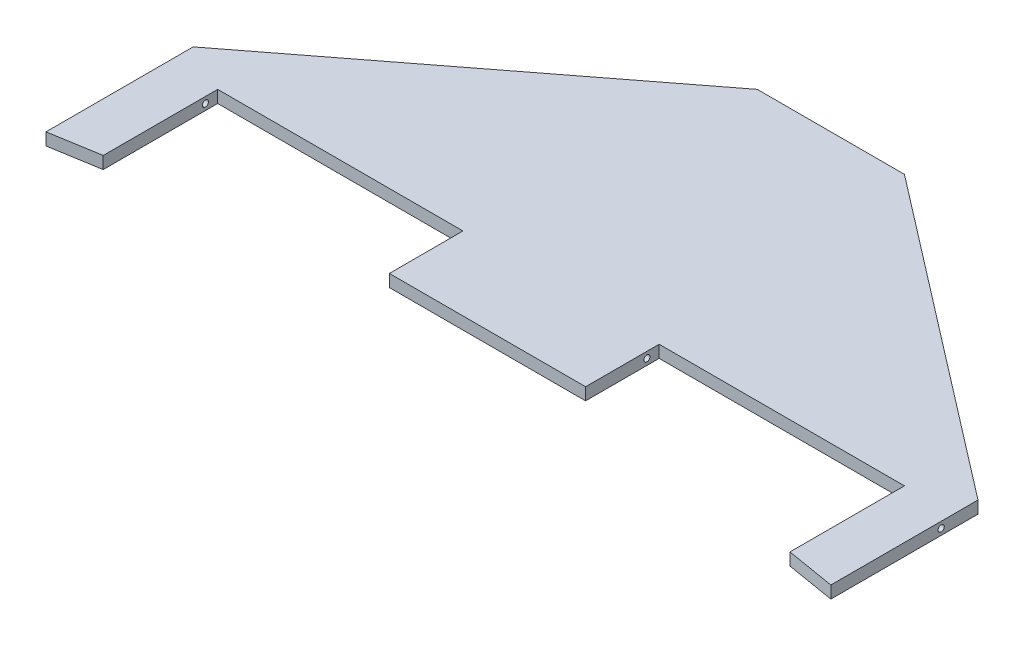
ISO-10303-21;
HEADER;
FILE_DESCRIPTION(('STEP AP214'),'2;1');
FILE_NAME('part.step','',(''),(''),'','','');
FILE_SCHEMA(('AUTOMOTIVE_DESIGN { 1 0 10303 214 1 1 1 1 }'));
ENDSEC;
DATA;
#1=APPLICATION_CONTEXT('core data for automotive mechanical design processes');
#2=APPLICATION_PROTOCOL_DEFINITION('international standard','automotive_design',2000,#1);
#3=PRODUCT_CONTEXT('',#1,'mechanical');
#4=PRODUCT('Part','Part','',(#3));
#5=PRODUCT_RELATED_PRODUCT_CATEGORY('part','',(#4));
#6=PRODUCT_DEFINITION_FORMATION('','',#4);
#7=PRODUCT_DEFINITION_CONTEXT('part definition',#1,'design');
#8=PRODUCT_DEFINITION('design','',#6,#7);
#9=PRODUCT_DEFINITION_SHAPE('','',#8);
#10=(LENGTH_UNIT() NAMED_UNIT(*) SI_UNIT(.MILLI.,.METRE.));
#11=(NAMED_UNIT(*) PLANE_ANGLE_UNIT() SI_UNIT($,.RADIAN.));
#12=(NAMED_UNIT(*) SI_UNIT($,.STERADIAN.) SOLID_ANGLE_UNIT());
#13=UNCERTAINTY_MEASURE_WITH_UNIT(LENGTH_MEASURE(1.E-05),#10,'distance_accuracy_value','');
#14=(GEOMETRIC_REPRESENTATION_CONTEXT(3) GLOBAL_UNCERTAINTY_ASSIGNED_CONTEXT((#13)) GLOBAL_UNIT_ASSIGNED_CONTEXT((#10,
#11,#12)) REPRESENTATION_CONTEXT('',''));
#15=CARTESIAN_POINT('',(0.,0.,0.));
#16=DIRECTION('',(0.,0.,1.));
#17=DIRECTION('',(1.,0.,0.));
#18=AXIS2_PLACEMENT_3D('',#15,#16,#17);
#19=CARTESIAN_POINT('',(-142.738159829329,3.175,6.24473833025289));
#20=DIRECTION('',(-0.609710760849692,0.,-0.7926239891046));
#21=DIRECTION('',(-0.7926239891046,0.,0.609710760849692));
#22=AXIS2_PLACEMENT_3D('',#19,#20,#21);
#23=PLANE('',#22);
#24=DIRECTION('',(0.7926239891046,0.,-0.609710760849692));
#25=VECTOR('',#24,1.);
#26=CARTESIAN_POINT('',(-142.738159829329,0.,6.24473833025289));
#27=LINE('',#26,#25);
#28=CARTESIAN_POINT('',(-101.6,0.,-25.4));
#29=VERTEX_POINT('',#28);
#30=CARTESIAN_POINT('',(-19.05,0.,-88.9));
#31=VERTEX_POINT('',#30);
#32=EDGE_CURVE('E143',#29,#31,#27,.T.);
#33=ORIENTED_EDGE('',*,*,#32,.F.);
#34=DIRECTION('',(0.,-1.,0.));
#35=VECTOR('',#34,1.);
#36=CARTESIAN_POINT('',(-101.6,3.175,-25.4));
#37=LINE('',#36,#35);
#38=CARTESIAN_POINT('',(-101.6,3.175,-25.4));
#39=VERTEX_POINT('',#38);
#40=EDGE_CURVE('E11',#39,#29,#37,.T.);
#41=ORIENTED_EDGE('',*,*,#40,.F.);
#42=DIRECTION('',(0.7926239891046,0.,-0.609710760849692));
#43=VECTOR('',#42,1.);
#44=CARTESIAN_POINT('',(-142.738159829329,3.175,6.24473833025289));
#45=LINE('',#44,#43);
#46=CARTESIAN_POINT('',(-19.05,3.175,-88.9));
#47=VERTEX_POINT('',#46);
#48=EDGE_CURVE('E184',#39,#47,#45,.T.);
#49=ORIENTED_EDGE('',*,*,#48,.T.);
#50=DIRECTION('',(0.,-1.,0.));
#51=VECTOR('',#50,1.);
#52=CARTESIAN_POINT('',(-19.05,3.175,-88.9));
#53=LINE('',#52,#51);
#54=EDGE_CURVE('E42',#47,#31,#53,.T.);
#55=ORIENTED_EDGE('',*,*,#54,.T.);
#56=EDGE_LOOP('',(#33,#41,#49,#55));
#57=FACE_BOUND('',#56,.T.);
#58=ADVANCED_FACE('F28',(#57),#23,.T.);
#59=CARTESIAN_POINT('',(-101.6,3.175,-38.1));
#60=DIRECTION('',(1.,0.,0.));
#61=DIRECTION('',(0.,0.,-1.));
#62=AXIS2_PLACEMENT_3D('',#59,#60,#61);
#63=PLANE('',#62);
#64=CARTESIAN_POINT('',(-101.6,1.58749999999999,-15.875));
#65=DIRECTION('',(1.,0.,0.));
#66=DIRECTION('',(0.,0.,-1.));
#67=AXIS2_PLACEMENT_3D('',#64,#65,#66);
#68=CIRCLE('',#67,0.793750000000003);
#69=CARTESIAN_POINT('',(-101.6,1.58749999999999,-16.66875));
#70=VERTEX_POINT('',#69);
#71=EDGE_CURVE('E337',#70,#70,#68,.T.);
#72=ORIENTED_EDGE('',*,*,#71,.T.);
#73=EDGE_LOOP('',(#72));
#74=FACE_BOUND('',#73,.T.);
#75=DIRECTION('',(0.,0.,1.));
#76=VECTOR('',#75,1.);
#77=CARTESIAN_POINT('',(-101.6,0.,-38.1));
#78=LINE('',#77,#76);
#79=CARTESIAN_POINT('',(-101.6,0.,12.7));
#80=VERTEX_POINT('',#79);
#81=EDGE_CURVE('E133',#29,#80,#78,.T.);
#82=ORIENTED_EDGE('',*,*,#81,.T.);
#83=DIRECTION('',(0.,-1.,0.));
#84=VECTOR('',#83,1.);
#85=CARTESIAN_POINT('',(-101.6,3.175,12.7));
#86=LINE('',#85,#84);
#87=CARTESIAN_POINT('',(-101.6,3.175,12.7));
#88=VERTEX_POINT('',#87);
#89=EDGE_CURVE('E35',#88,#80,#86,.T.);
#90=ORIENTED_EDGE('',*,*,#89,.F.);
#91=DIRECTION('',(0.,0.,1.));
#92=VECTOR('',#91,1.);
#93=CARTESIAN_POINT('',(-101.6,3.175,-38.1));
#94=LINE('',#93,#92);
#95=EDGE_CURVE('E135',#39,#88,#94,.T.);
#96=ORIENTED_EDGE('',*,*,#95,.F.);
#97=ORIENTED_EDGE('',*,*,#40,.T.);
#98=EDGE_LOOP('',(#82,#90,#96,#97));
#99=FACE_BOUND('',#98,.T.);
#100=ADVANCED_FACE('F131',(#74,#99),#63,.F.);
#101=CARTESIAN_POINT('',(-166.577888979245,3.175,23.5296481632075));
#102=DIRECTION('',(0.164398987305357,0.,0.986393923832144));
#103=DIRECTION('',(0.986393923832144,0.,-0.164398987305357));
#104=AXIS2_PLACEMENT_3D('',#101,#102,#103);
#105=PLANE('',#104);
#106=DIRECTION('',(-0.986393923832144,0.,0.164398987305357));
#107=VECTOR('',#106,1.);
#108=CARTESIAN_POINT('',(-166.577888979245,0.,23.5296481632075));
#109=LINE('',#108,#107);
#110=CARTESIAN_POINT('',(-88.9,0.,10.5833333333333));
#111=VERTEX_POINT('',#110);
#112=EDGE_CURVE('E146',#111,#80,#109,.T.);
#113=ORIENTED_EDGE('',*,*,#112,.F.);
#114=DIRECTION('',(0.,-1.,0.));
#115=VECTOR('',#114,1.);
#116=CARTESIAN_POINT('',(-88.9,3.175,10.5833333333333));
#117=LINE('',#116,#115);
#118=CARTESIAN_POINT('',(-88.9,3.175,10.5833333333333));
#119=VERTEX_POINT('',#118);
#120=EDGE_CURVE('E240',#119,#111,#117,.T.);
#121=ORIENTED_EDGE('',*,*,#120,.F.);
#122=DIRECTION('',(-0.986393923832144,0.,0.164398987305357));
#123=VECTOR('',#122,1.);
#124=CARTESIAN_POINT('',(-166.577888979245,3.175,23.5296481632075));
#125=LINE('',#124,#123);
#126=EDGE_CURVE('E187',#119,#88,#125,.T.);
#127=ORIENTED_EDGE('',*,*,#126,.T.);
#128=ORIENTED_EDGE('',*,*,#89,.T.);
#129=EDGE_LOOP('',(#113,#121,#127,#128));
#130=FACE_BOUND('',#129,.T.);
#131=ADVANCED_FACE('F242',(#130),#105,.T.);
#132=CARTESIAN_POINT('',(-88.9,3.175,-38.1000000000001));
#133=DIRECTION('',(1.,0.,0.));
#134=DIRECTION('',(0.,0.,-1.));
#135=AXIS2_PLACEMENT_3D('',#132,#133,#134);
#136=PLANE('',#135);
#137=CARTESIAN_POINT('',(-88.9,1.58749999999999,-15.875));
#138=DIRECTION('',(1.,0.,0.));
#139=DIRECTION('',(0.,0.,-1.));
#140=AXIS2_PLACEMENT_3D('',#137,#138,#139);
#141=CIRCLE('',#140,0.793750000000003);
#142=CARTESIAN_POINT('',(-88.9,1.58749999999999,-16.66875));
#143=VERTEX_POINT('',#142);
#144=EDGE_CURVE('E148',#143,#143,#141,.T.);
#145=ORIENTED_EDGE('',*,*,#144,.F.);
#146=EDGE_LOOP('',(#145));
#147=FACE_BOUND('',#146,.T.);
#148=DIRECTION('',(0.,0.,1.));
#149=VECTOR('',#148,1.);
#150=CARTESIAN_POINT('',(-88.9,0.,-38.1000000000001));
#151=LINE('',#150,#149);
#152=CARTESIAN_POINT('',(-88.9,0.,-19.05));
#153=VERTEX_POINT('',#152);
#154=EDGE_CURVE('E156',#153,#111,#151,.T.);
#155=ORIENTED_EDGE('',*,*,#154,.F.);
#156=DIRECTION('',(0.,-1.,0.));
#157=VECTOR('',#156,1.);
#158=CARTESIAN_POINT('',(-88.9,3.175,-19.05));
#159=LINE('',#158,#157);
#160=CARTESIAN_POINT('',(-88.9,3.175,-19.05));
#161=VERTEX_POINT('',#160);
#162=EDGE_CURVE('E238',#161,#153,#159,.T.);
#163=ORIENTED_EDGE('',*,*,#162,.F.);
#164=DIRECTION('',(0.,0.,1.));
#165=VECTOR('',#164,1.);
#166=CARTESIAN_POINT('',(-88.9,3.175,-38.1000000000001));
#167=LINE('',#166,#165);
#168=EDGE_CURVE('E190',#161,#119,#167,.T.);
#169=ORIENTED_EDGE('',*,*,#168,.T.);
#170=ORIENTED_EDGE('',*,*,#120,.T.);
#171=EDGE_LOOP('',(#155,#163,#169,#170));
#172=FACE_BOUND('',#171,.T.);
#173=ADVANCED_FACE('F249',(#147,#172),#136,.T.);
#174=CARTESIAN_POINT('',(-176.849497006446,3.175,-19.05));
#175=DIRECTION('',(0.,0.,1.));
#176=DIRECTION('',(1.,0.,0.));
#177=AXIS2_PLACEMENT_3D('',#174,#175,#176);
#178=PLANE('',#177);
#179=DIRECTION('',(-1.,0.,0.));
#180=VECTOR('',#179,1.);
#181=CARTESIAN_POINT('',(-176.849497006446,0.,-19.05));
#182=LINE('',#181,#180);
#183=CARTESIAN_POINT('',(-25.4,0.,-19.05));
#184=VERTEX_POINT('',#183);
#185=EDGE_CURVE('E158',#184,#153,#182,.T.);
#186=ORIENTED_EDGE('',*,*,#185,.F.);
#187=DIRECTION('',(0.,-1.,0.));
#188=VECTOR('',#187,1.);
#189=CARTESIAN_POINT('',(-25.4,3.175,-19.05));
#190=LINE('',#189,#188);
#191=CARTESIAN_POINT('',(-25.4,3.175,-19.05));
#192=VERTEX_POINT('',#191);
#193=EDGE_CURVE('E236',#192,#184,#190,.T.);
#194=ORIENTED_EDGE('',*,*,#193,.F.);
#195=DIRECTION('',(-1.,0.,0.));
#196=VECTOR('',#195,1.);
#197=CARTESIAN_POINT('',(-176.849497006446,3.175,-19.05));
#198=LINE('',#197,#196);
#199=EDGE_CURVE('E193',#192,#161,#198,.T.);
#200=ORIENTED_EDGE('',*,*,#199,.T.);
#201=ORIENTED_EDGE('',*,*,#162,.T.);
#202=EDGE_LOOP('',(#186,#194,#200,#201));
#203=FACE_BOUND('',#202,.T.);
#204=ADVANCED_FACE('F252',(#203),#178,.T.);
#205=CARTESIAN_POINT('',(-25.4,3.175,-38.1));
#206=DIRECTION('',(-1.,0.,0.));
#207=DIRECTION('',(0.,0.,1.));
#208=AXIS2_PLACEMENT_3D('',#205,#206,#207);
#209=PLANE('',#208);
#210=CARTESIAN_POINT('',(-25.4,1.58749999999999,-15.875));
#211=DIRECTION('',(-1.,0.,0.));
#212=DIRECTION('',(0.,0.,1.));
#213=AXIS2_PLACEMENT_3D('',#210,#211,#212);
#214=CIRCLE('',#213,0.793750000000003);
#215=CARTESIAN_POINT('',(-25.4,1.58749999999999,-15.08125));
#216=VERTEX_POINT('',#215);
#217=EDGE_CURVE('E151',#216,#216,#214,.T.);
#218=ORIENTED_EDGE('',*,*,#217,.F.);
#219=EDGE_LOOP('',(#218));
#220=FACE_BOUND('',#219,.T.);
#221=DIRECTION('',(0.,0.,-1.));
#222=VECTOR('',#221,1.);
#223=CARTESIAN_POINT('',(-25.4,0.,-38.1));
#224=LINE('',#223,#222);
#225=CARTESIAN_POINT('',(-25.4,0.,0.));
#226=VERTEX_POINT('',#225);
#227=EDGE_CURVE('E161',#226,#184,#224,.T.);
#228=ORIENTED_EDGE('',*,*,#227,.F.);
#229=DIRECTION('',(0.,-1.,0.));
#230=VECTOR('',#229,1.);
#231=CARTESIAN_POINT('',(-25.4,3.175,0.));
#232=LINE('',#231,#230);
#233=CARTESIAN_POINT('',(-25.4,3.175,0.));
#234=VERTEX_POINT('',#233);
#235=EDGE_CURVE('E234',#234,#226,#232,.T.);
#236=ORIENTED_EDGE('',*,*,#235,.F.);
#237=DIRECTION('',(0.,0.,-1.));
#238=VECTOR('',#237,1.);
#239=CARTESIAN_POINT('',(-25.4,3.175,-38.1));
#240=LINE('',#239,#238);
#241=EDGE_CURVE('E196',#234,#192,#240,.T.);
#242=ORIENTED_EDGE('',*,*,#241,.T.);
#243=ORIENTED_EDGE('',*,*,#193,.T.);
#244=EDGE_LOOP('',(#228,#236,#242,#243));
#245=FACE_BOUND('',#244,.T.);
#246=ADVANCED_FACE('F257',(#220,#245),#209,.T.);
#247=CARTESIAN_POINT('',(-176.849497006446,3.175,0.));
#248=DIRECTION('',(0.,0.,1.));
#249=DIRECTION('',(1.,0.,0.));
#250=AXIS2_PLACEMENT_3D('',#247,#248,#249);
#251=PLANE('',#250);
#252=DIRECTION('',(-1.,0.,0.));
#253=VECTOR('',#252,1.);
#254=CARTESIAN_POINT('',(-176.849497006446,0.,0.));
#255=LINE('',#254,#253);
#256=CARTESIAN_POINT('',(25.4,0.,0.));
#257=VERTEX_POINT('',#256);
#258=EDGE_CURVE('E164',#257,#226,#255,.T.);
#259=ORIENTED_EDGE('',*,*,#258,.F.);
#260=DIRECTION('',(0.,-1.,0.));
#261=VECTOR('',#260,1.);
#262=CARTESIAN_POINT('',(25.4,3.175,0.));
#263=LINE('',#262,#261);
#264=CARTESIAN_POINT('',(25.4,3.175,0.));
#265=VERTEX_POINT('',#264);
#266=EDGE_CURVE('E232',#265,#257,#263,.T.);
#267=ORIENTED_EDGE('',*,*,#266,.F.);
#268=DIRECTION('',(-1.,0.,0.));
#269=VECTOR('',#268,1.);
#270=CARTESIAN_POINT('',(-176.849497006446,3.175,0.));
#271=LINE('',#270,#269);
#272=EDGE_CURVE('E199',#265,#234,#271,.T.);
#273=ORIENTED_EDGE('',*,*,#272,.T.);
#274=ORIENTED_EDGE('',*,*,#235,.T.);
#275=EDGE_LOOP('',(#259,#267,#273,#274));
#276=FACE_BOUND('',#275,.T.);
#277=ADVANCED_FACE('F260',(#276),#251,.T.);
#278=CARTESIAN_POINT('',(25.4,3.175,-38.0999999999998));
#279=DIRECTION('',(-1.,0.,0.));
#280=DIRECTION('',(0.,0.,1.));
#281=AXIS2_PLACEMENT_3D('',#278,#279,#280);
#282=PLANE('',#281);
#283=CARTESIAN_POINT('',(25.4,1.58749999999999,-15.875));
#284=DIRECTION('',(-1.,0.,0.));
#285=DIRECTION('',(0.,0.,1.));
#286=AXIS2_PLACEMENT_3D('',#283,#284,#285);
#287=CIRCLE('',#286,0.793750000000003);
#288=CARTESIAN_POINT('',(25.4,1.58749999999999,-15.08125));
#289=VERTEX_POINT('',#288);
#290=EDGE_CURVE('E344',#289,#289,#287,.T.);
#291=ORIENTED_EDGE('',*,*,#290,.T.);
#292=EDGE_LOOP('',(#291));
#293=FACE_BOUND('',#292,.T.);
#294=DIRECTION('',(0.,0.,-1.));
#295=VECTOR('',#294,1.);
#296=CARTESIAN_POINT('',(25.4,0.,-38.0999999999998));
#297=LINE('',#296,#295);
#298=CARTESIAN_POINT('',(25.4,0.,-19.05));
#299=VERTEX_POINT('',#298);
#300=EDGE_CURVE('E167',#257,#299,#297,.T.);
#301=ORIENTED_EDGE('',*,*,#300,.T.);
#302=DIRECTION('',(0.,-1.,0.));
#303=VECTOR('',#302,1.);
#304=CARTESIAN_POINT('',(25.4,3.175,-19.05));
#305=LINE('',#304,#303);
#306=CARTESIAN_POINT('',(25.4,3.175,-19.05));
#307=VERTEX_POINT('',#306);
#308=EDGE_CURVE('E229',#307,#299,#305,.T.);
#309=ORIENTED_EDGE('',*,*,#308,.F.);
#310=DIRECTION('',(0.,0.,-1.));
#311=VECTOR('',#310,1.);
#312=CARTESIAN_POINT('',(25.4,3.175,-38.0999999999998));
#313=LINE('',#312,#311);
#314=EDGE_CURVE('E202',#265,#307,#313,.T.);
#315=ORIENTED_EDGE('',*,*,#314,.F.);
#316=ORIENTED_EDGE('',*,*,#266,.T.);
#317=EDGE_LOOP('',(#301,#309,#315,#316));
#318=FACE_BOUND('',#317,.T.);
#319=ADVANCED_FACE('F266',(#293,#318),#282,.F.);
#320=CARTESIAN_POINT('',(-176.849497006446,3.175,-19.05));
#321=DIRECTION('',(0.,0.,-1.));
#322=DIRECTION('',(-1.,0.,0.));
#323=AXIS2_PLACEMENT_3D('',#320,#321,#322);
#324=PLANE('',#323);
#325=DIRECTION('',(1.,0.,0.));
#326=VECTOR('',#325,1.);
#327=CARTESIAN_POINT('',(-176.849497006446,0.,-19.05));
#328=LINE('',#327,#326);
#329=CARTESIAN_POINT('',(88.9,0.,-19.05));
#330=VERTEX_POINT('',#329);
#331=EDGE_CURVE('E169',#299,#330,#328,.T.);
#332=ORIENTED_EDGE('',*,*,#331,.T.);
#333=DIRECTION('',(0.,-1.,0.));
#334=VECTOR('',#333,1.);
#335=CARTESIAN_POINT('',(88.9,3.175,-19.05));
#336=LINE('',#335,#334);
#337=CARTESIAN_POINT('',(88.9,3.175,-19.05));
#338=VERTEX_POINT('',#337);
#339=EDGE_CURVE('E226',#338,#330,#336,.T.);
#340=ORIENTED_EDGE('',*,*,#339,.F.);
#341=DIRECTION('',(1.,0.,0.));
#342=VECTOR('',#341,1.);
#343=CARTESIAN_POINT('',(-176.849497006446,3.175,-19.05));
#344=LINE('',#343,#342);
#345=EDGE_CURVE('E204',#307,#338,#344,.T.);
#346=ORIENTED_EDGE('',*,*,#345,.F.);
#347=ORIENTED_EDGE('',*,*,#308,.T.);
#348=EDGE_LOOP('',(#332,#340,#346,#347));
#349=FACE_BOUND('',#348,.T.);
#350=ADVANCED_FACE('F270',(#349),#324,.F.);
#351=CARTESIAN_POINT('',(88.9,3.175,-38.0999999999997));
#352=DIRECTION('',(1.,0.,0.));
#353=DIRECTION('',(0.,0.,-1.));
#354=AXIS2_PLACEMENT_3D('',#351,#352,#353);
#355=PLANE('',#354);
#356=CARTESIAN_POINT('',(88.9,1.58749999999999,-15.875));
#357=DIRECTION('',(1.,0.,0.));
#358=DIRECTION('',(0.,0.,-1.));
#359=AXIS2_PLACEMENT_3D('',#356,#357,#358);
#360=CIRCLE('',#359,0.793750000000003);
#361=CARTESIAN_POINT('',(88.9,1.58749999999999,-16.66875));
#362=VERTEX_POINT('',#361);
#363=EDGE_CURVE('E339',#362,#362,#360,.T.);
#364=ORIENTED_EDGE('',*,*,#363,.T.);
#365=EDGE_LOOP('',(#364));
#366=FACE_BOUND('',#365,.T.);
#367=DIRECTION('',(0.,0.,1.));
#368=VECTOR('',#367,1.);
#369=CARTESIAN_POINT('',(88.9,0.,-38.0999999999997));
#370=LINE('',#369,#368);
#371=CARTESIAN_POINT('',(88.9,0.,10.5833333333333));
#372=VERTEX_POINT('',#371);
#373=EDGE_CURVE('E171',#330,#372,#370,.T.);
#374=ORIENTED_EDGE('',*,*,#373,.T.);
#375=DIRECTION('',(0.,-1.,0.));
#376=VECTOR('',#375,1.);
#377=CARTESIAN_POINT('',(88.9,3.175,10.5833333333333));
#378=LINE('',#377,#376);
#379=CARTESIAN_POINT('',(88.9,3.175,10.5833333333333));
#380=VERTEX_POINT('',#379);
#381=EDGE_CURVE('E223',#380,#372,#378,.T.);
#382=ORIENTED_EDGE('',*,*,#381,.F.);
#383=DIRECTION('',(0.,0.,1.));
#384=VECTOR('',#383,1.);
#385=CARTESIAN_POINT('',(88.9,3.175,-38.0999999999997));
#386=LINE('',#385,#384);
#387=EDGE_CURVE('E206',#338,#380,#386,.T.);
#388=ORIENTED_EDGE('',*,*,#387,.F.);
#389=ORIENTED_EDGE('',*,*,#339,.T.);
#390=EDGE_LOOP('',(#374,#382,#388,#389));
#391=FACE_BOUND('',#390,.T.);
#392=ADVANCED_FACE('F275',(#366,#391),#355,.F.);
#393=CARTESIAN_POINT('',(-177.561672763029,3.175,-33.8269454605048));
#394=DIRECTION('',(0.164398987305357,0.,-0.986393923832144));
#395=DIRECTION('',(-0.986393923832144,0.,-0.164398987305357));
#396=AXIS2_PLACEMENT_3D('',#393,#394,#395);
#397=PLANE('',#396);
#398=DIRECTION('',(0.986393923832144,0.,0.164398987305357));
#399=VECTOR('',#398,1.);
#400=CARTESIAN_POINT('',(-177.561672763029,0.,-33.8269454605048));
#401=LINE('',#400,#399);
#402=CARTESIAN_POINT('',(101.6,0.,12.7));
#403=VERTEX_POINT('',#402);
#404=EDGE_CURVE('E173',#372,#403,#401,.T.);
#405=ORIENTED_EDGE('',*,*,#404,.T.);
#406=DIRECTION('',(0.,-1.,0.));
#407=VECTOR('',#406,1.);
#408=CARTESIAN_POINT('',(101.6,3.175,12.7));
#409=LINE('',#408,#407);
#410=CARTESIAN_POINT('',(101.6,3.175,12.7));
#411=VERTEX_POINT('',#410);
#412=EDGE_CURVE('E221',#411,#403,#409,.T.);
#413=ORIENTED_EDGE('',*,*,#412,.F.);
#414=DIRECTION('',(0.986393923832144,0.,0.164398987305357));
#415=VECTOR('',#414,1.);
#416=CARTESIAN_POINT('',(-177.561672763029,3.175,-33.8269454605048));
#417=LINE('',#416,#415);
#418=EDGE_CURVE('E208',#380,#411,#417,.T.);
#419=ORIENTED_EDGE('',*,*,#418,.F.);
#420=ORIENTED_EDGE('',*,*,#381,.T.);
#421=EDGE_LOOP('',(#405,#413,#419,#420));
#422=FACE_BOUND('',#421,.T.);
#423=ADVANCED_FACE('F279',(#422),#397,.F.);
#424=CARTESIAN_POINT('',(101.6,3.175,-38.1));
#425=DIRECTION('',(1.,0.,0.));
#426=DIRECTION('',(0.,0.,-1.));
#427=AXIS2_PLACEMENT_3D('',#424,#425,#426);
#428=PLANE('',#427);
#429=CARTESIAN_POINT('',(101.6,1.58749999999999,-15.875));
#430=DIRECTION('',(1.,0.,0.));
#431=DIRECTION('',(0.,0.,-1.));
#432=AXIS2_PLACEMENT_3D('',#429,#430,#431);
#433=CIRCLE('',#432,0.793750000000003);
#434=CARTESIAN_POINT('',(101.6,1.58749999999999,-16.66875));
#435=VERTEX_POINT('',#434);
#436=EDGE_CURVE('E335',#435,#435,#433,.T.);
#437=ORIENTED_EDGE('',*,*,#436,.F.);
#438=EDGE_LOOP('',(#437));
#439=FACE_BOUND('',#438,.T.);
#440=DIRECTION('',(0.,0.,1.));
#441=VECTOR('',#440,1.);
#442=CARTESIAN_POINT('',(101.6,0.,-38.1));
#443=LINE('',#442,#441);
#444=CARTESIAN_POINT('',(101.6,0.,-25.4));
#445=VERTEX_POINT('',#444);
#446=EDGE_CURVE('E176',#445,#403,#443,.T.);
#447=ORIENTED_EDGE('',*,*,#446,.F.);
#448=DIRECTION('',(0.,-1.,0.));
#449=VECTOR('',#448,1.);
#450=CARTESIAN_POINT('',(101.6,3.175,-25.4));
#451=LINE('',#450,#449);
#452=CARTESIAN_POINT('',(101.6,3.175,-25.4));
#453=VERTEX_POINT('',#452);
#454=EDGE_CURVE('E219',#453,#445,#451,.T.);
#455=ORIENTED_EDGE('',*,*,#454,.F.);
#456=DIRECTION('',(0.,0.,1.));
#457=VECTOR('',#456,1.);
#458=CARTESIAN_POINT('',(101.6,3.175,-38.1));
#459=LINE('',#458,#457);
#460=EDGE_CURVE('E210',#453,#411,#459,.T.);
#461=ORIENTED_EDGE('',*,*,#460,.T.);
#462=ORIENTED_EDGE('',*,*,#412,.T.);
#463=EDGE_LOOP('',(#447,#455,#461,#462));
#464=FACE_BOUND('',#463,.T.);
#465=ADVANCED_FACE('F283',(#439,#464),#428,.T.);
#466=CARTESIAN_POINT('',(-79.4742193088827,3.175,-164.687861006833));
#467=DIRECTION('',(-0.609710760849692,0.,0.7926239891046));
#468=DIRECTION('',(0.7926239891046,0.,0.609710760849692));
#469=AXIS2_PLACEMENT_3D('',#466,#467,#468);
#470=PLANE('',#469);
#471=DIRECTION('',(-0.7926239891046,0.,-0.609710760849692));
#472=VECTOR('',#471,1.);
#473=CARTESIAN_POINT('',(-79.4742193088827,0.,-164.687861006833));
#474=LINE('',#473,#472);
#475=CARTESIAN_POINT('',(19.05,0.,-88.9));
#476=VERTEX_POINT('',#475);
#477=EDGE_CURVE('E179',#445,#476,#474,.T.);
#478=ORIENTED_EDGE('',*,*,#477,.T.);
#479=DIRECTION('',(0.,-1.,0.));
#480=VECTOR('',#479,1.);
#481=CARTESIAN_POINT('',(19.05,3.175,-88.9));
#482=LINE('',#481,#480);
#483=CARTESIAN_POINT('',(19.05,3.175,-88.9));
#484=VERTEX_POINT('',#483);
#485=EDGE_CURVE('E217',#484,#476,#482,.T.);
#486=ORIENTED_EDGE('',*,*,#485,.F.);
#487=DIRECTION('',(-0.7926239891046,0.,-0.609710760849692));
#488=VECTOR('',#487,1.);
#489=CARTESIAN_POINT('',(-79.4742193088827,3.175,-164.687861006833));
#490=LINE('',#489,#488);
#491=EDGE_CURVE('E50',#453,#484,#490,.T.);
#492=ORIENTED_EDGE('',*,*,#491,.F.);
#493=ORIENTED_EDGE('',*,*,#454,.T.);
#494=EDGE_LOOP('',(#478,#486,#492,#493));
#495=FACE_BOUND('',#494,.T.);
#496=ADVANCED_FACE('F286',(#495),#470,.F.);
#497=CARTESIAN_POINT('',(-176.849497006446,3.175,-88.9));
#498=DIRECTION('',(0.,0.,-1.));
#499=DIRECTION('',(-1.,0.,0.));
#500=AXIS2_PLACEMENT_3D('',#497,#498,#499);
#501=PLANE('',#500);
#502=DIRECTION('',(1.,0.,0.));
#503=VECTOR('',#502,1.);
#504=CARTESIAN_POINT('',(-176.849497006446,0.,-88.9));
#505=LINE('',#504,#503);
#506=EDGE_CURVE('E182',#31,#476,#505,.T.);
#507=ORIENTED_EDGE('',*,*,#506,.F.);
#508=ORIENTED_EDGE('',*,*,#54,.F.);
#509=DIRECTION('',(1.,0.,0.));
#510=VECTOR('',#509,1.);
#511=CARTESIAN_POINT('',(-176.849497006446,3.175,-88.9));
#512=LINE('',#511,#510);
#513=EDGE_CURVE('E214',#47,#484,#512,.T.);
#514=ORIENTED_EDGE('',*,*,#513,.T.);
#515=ORIENTED_EDGE('',*,*,#485,.T.);
#516=EDGE_LOOP('',(#507,#508,#514,#515));
#517=FACE_BOUND('',#516,.T.);
#518=ADVANCED_FACE('F287',(#517),#501,.T.);
#519=CARTESIAN_POINT('',(-176.849497006446,3.175,-38.1));
#520=DIRECTION('',(0.,1.,0.));
#521=DIRECTION('',(0.,0.,1.));
#522=AXIS2_PLACEMENT_3D('',#519,#520,#521);
#523=PLANE('',#522);
#524=ORIENTED_EDGE('',*,*,#48,.F.);
#525=ORIENTED_EDGE('',*,*,#95,.T.);
#526=ORIENTED_EDGE('',*,*,#126,.F.);
#527=ORIENTED_EDGE('',*,*,#168,.F.);
#528=ORIENTED_EDGE('',*,*,#199,.F.);
#529=ORIENTED_EDGE('',*,*,#241,.F.);
#530=ORIENTED_EDGE('',*,*,#272,.F.);
#531=ORIENTED_EDGE('',*,*,#314,.T.);
#532=ORIENTED_EDGE('',*,*,#345,.T.);
#533=ORIENTED_EDGE('',*,*,#387,.T.);
#534=ORIENTED_EDGE('',*,*,#418,.T.);
#535=ORIENTED_EDGE('',*,*,#460,.F.);
#536=ORIENTED_EDGE('',*,*,#491,.T.);
#537=ORIENTED_EDGE('',*,*,#513,.F.);
#538=EDGE_LOOP('',(#524,#525,#526,#527,#528,#529,#530,#531,#532,#533,#534,#535,#536,#537));
#539=FACE_BOUND('',#538,.T.);
#540=ADVANCED_FACE('F245',(#539),#523,.T.);
#541=CARTESIAN_POINT('',(-176.849497006446,0.,-38.1));
#542=DIRECTION('',(0.,1.,0.));
#543=DIRECTION('',(0.,0.,1.));
#544=AXIS2_PLACEMENT_3D('',#541,#542,#543);
#545=PLANE('',#544);
#546=ORIENTED_EDGE('',*,*,#32,.T.);
#547=ORIENTED_EDGE('',*,*,#506,.T.);
#548=ORIENTED_EDGE('',*,*,#477,.F.);
#549=ORIENTED_EDGE('',*,*,#446,.T.);
#550=ORIENTED_EDGE('',*,*,#404,.F.);
#551=ORIENTED_EDGE('',*,*,#373,.F.);
#552=ORIENTED_EDGE('',*,*,#331,.F.);
#553=ORIENTED_EDGE('',*,*,#300,.F.);
#554=ORIENTED_EDGE('',*,*,#258,.T.);
#555=ORIENTED_EDGE('',*,*,#227,.T.);
#556=ORIENTED_EDGE('',*,*,#185,.T.);
#557=ORIENTED_EDGE('',*,*,#154,.T.);
#558=ORIENTED_EDGE('',*,*,#112,.T.);
#559=ORIENTED_EDGE('',*,*,#81,.F.);
#560=EDGE_LOOP('',(#546,#547,#548,#549,#550,#551,#552,#553,#554,#555,#556,#557,#558,#559));
#561=FACE_BOUND('',#560,.T.);
#562=ADVANCED_FACE('F141',(#561),#545,.F.);
#563=CARTESIAN_POINT('',(-101.6,1.58749999999999,-15.875));
#564=DIRECTION('',(1.,0.,0.));
#565=DIRECTION('',(0.,0.,-1.));
#566=AXIS2_PLACEMENT_3D('',#563,#564,#565);
#567=CYLINDRICAL_SURFACE('',#566,0.793750000000003);
#568=ORIENTED_EDGE('',*,*,#436,.T.);
#569=EDGE_LOOP('',(#568));
#570=FACE_BOUND('',#569,.T.);
#571=ORIENTED_EDGE('',*,*,#363,.F.);
#572=EDGE_LOOP('',(#571));
#573=FACE_BOUND('',#572,.T.);
#574=ADVANCED_FACE('F353',(#570,#573),#567,.F.);
#575=ORIENTED_EDGE('',*,*,#217,.T.);
#576=EDGE_LOOP('',(#575));
#577=FACE_BOUND('',#576,.T.);
#578=ORIENTED_EDGE('',*,*,#290,.F.);
#579=EDGE_LOOP('',(#578));
#580=FACE_BOUND('',#579,.T.);
#581=ADVANCED_FACE('F349',(#577,#580),#567,.F.);
#582=ORIENTED_EDGE('',*,*,#144,.T.);
#583=EDGE_LOOP('',(#582));
#584=FACE_BOUND('',#583,.T.);
#585=ORIENTED_EDGE('',*,*,#71,.F.);
#586=EDGE_LOOP('',(#585));
#587=FACE_BOUND('',#586,.T.);
#588=ADVANCED_FACE('F352',(#584,#587),#567,.F.);
#589=CLOSED_SHELL('',(#58,#100,#131,#173,#204,#246,#277,#319,#350,#392,#423,#465,#496,#518,#540,
#562,#574,#581,#588));
#590=MANIFOLD_SOLID_BREP('B2',#589);
#591=ADVANCED_BREP_SHAPE_REPRESENTATION('',(#18,#590),#14);
#592=SHAPE_DEFINITION_REPRESENTATION(#9,#591);
ENDSEC;
END-ISO-10303-21;
